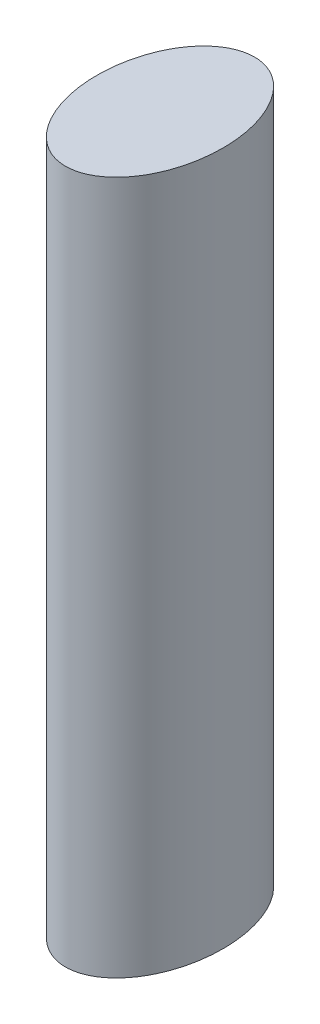
ISO-10303-21;
HEADER;
FILE_DESCRIPTION(('STEP AP214'),'2;1');
FILE_NAME('part.step','',(''),(''),'','','');
FILE_SCHEMA(('AUTOMOTIVE_DESIGN { 1 0 10303 214 1 1 1 1 }'));
ENDSEC;
DATA;
#1=APPLICATION_CONTEXT('core data for automotive mechanical design processes');
#2=APPLICATION_PROTOCOL_DEFINITION('international standard','automotive_design',2000,#1);
#3=PRODUCT_CONTEXT('',#1,'mechanical');
#4=PRODUCT('Part','Part','',(#3));
#5=PRODUCT_RELATED_PRODUCT_CATEGORY('part','',(#4));
#6=PRODUCT_DEFINITION_FORMATION('','',#4);
#7=PRODUCT_DEFINITION_CONTEXT('part definition',#1,'design');
#8=PRODUCT_DEFINITION('design','',#6,#7);
#9=PRODUCT_DEFINITION_SHAPE('','',#8);
#10=(LENGTH_UNIT() NAMED_UNIT(*) SI_UNIT(.MILLI.,.METRE.));
#11=(NAMED_UNIT(*) PLANE_ANGLE_UNIT() SI_UNIT($,.RADIAN.));
#12=(NAMED_UNIT(*) SI_UNIT($,.STERADIAN.) SOLID_ANGLE_UNIT());
#13=UNCERTAINTY_MEASURE_WITH_UNIT(LENGTH_MEASURE(1.E-05),#10,'distance_accuracy_value','');
#14=(GEOMETRIC_REPRESENTATION_CONTEXT(3) GLOBAL_UNCERTAINTY_ASSIGNED_CONTEXT((#13)) GLOBAL_UNIT_ASSIGNED_CONTEXT((#10,
#11,#12)) REPRESENTATION_CONTEXT('',''));
#15=CARTESIAN_POINT('',(0.,0.,0.));
#16=DIRECTION('',(0.,0.,1.));
#17=DIRECTION('',(1.,0.,0.));
#18=AXIS2_PLACEMENT_3D('',#15,#16,#17);
#19=CARTESIAN_POINT('',(0.,110.,0.));
#20=DIRECTION('',(0.,1.,0.));
#21=DIRECTION('',(0.,0.,-1.));
#22=AXIS2_PLACEMENT_3D('',#19,#20,#21);
#23=ELLIPSE('',#22,15.,10.);
#24=DIRECTION('',(0.,-1.,0.));
#25=VECTOR('',#24,1.);
#26=SURFACE_OF_LINEAR_EXTRUSION('',#23,#25);
#27=CARTESIAN_POINT('',(0.,110.,-15.));
#28=VERTEX_POINT('',#27);
#29=EDGE_CURVE('E10',#28,#28,#23,.T.);
#30=ORIENTED_EDGE('',*,*,#29,.F.);
#31=EDGE_LOOP('',(#30));
#32=FACE_BOUND('',#31,.T.);
#33=CARTESIAN_POINT('',(0.,0.,0.));
#34=DIRECTION('',(0.,1.,0.));
#35=DIRECTION('',(0.,0.,-1.));
#36=AXIS2_PLACEMENT_3D('',#33,#34,#35);
#37=ELLIPSE('',#36,15.,10.);
#38=CARTESIAN_POINT('',(0.,0.,-15.));
#39=VERTEX_POINT('',#38);
#40=EDGE_CURVE('E41',#39,#39,#37,.T.);
#41=ORIENTED_EDGE('',*,*,#40,.T.);
#42=EDGE_LOOP('',(#41));
#43=FACE_BOUND('',#42,.T.);
#44=ADVANCED_FACE('F37',(#32,#43),#26,.F.);
#45=CARTESIAN_POINT('',(0.,110.,0.));
#46=DIRECTION('',(0.,1.,0.));
#47=DIRECTION('',(0.,0.,1.));
#48=AXIS2_PLACEMENT_3D('',#45,#46,#47);
#49=PLANE('',#48);
#50=ORIENTED_EDGE('',*,*,#29,.T.);
#51=EDGE_LOOP('',(#50));
#52=FACE_BOUND('',#51,.T.);
#53=ADVANCED_FACE('F55',(#52),#49,.T.);
#54=CARTESIAN_POINT('',(0.,0.,0.));
#55=DIRECTION('',(0.,1.,0.));
#56=DIRECTION('',(0.,0.,1.));
#57=AXIS2_PLACEMENT_3D('',#54,#55,#56);
#58=PLANE('',#57);
#59=ORIENTED_EDGE('',*,*,#40,.F.);
#60=EDGE_LOOP('',(#59));
#61=FACE_BOUND('',#60,.T.);
#62=ADVANCED_FACE('F53',(#61),#58,.F.);
#63=CLOSED_SHELL('',(#44,#53,#62));
#64=MANIFOLD_SOLID_BREP('B2',#63);
#65=ADVANCED_BREP_SHAPE_REPRESENTATION('',(#18,#64),#14);
#66=SHAPE_DEFINITION_REPRESENTATION(#9,#65);
ENDSEC;
END-ISO-10303-21;
